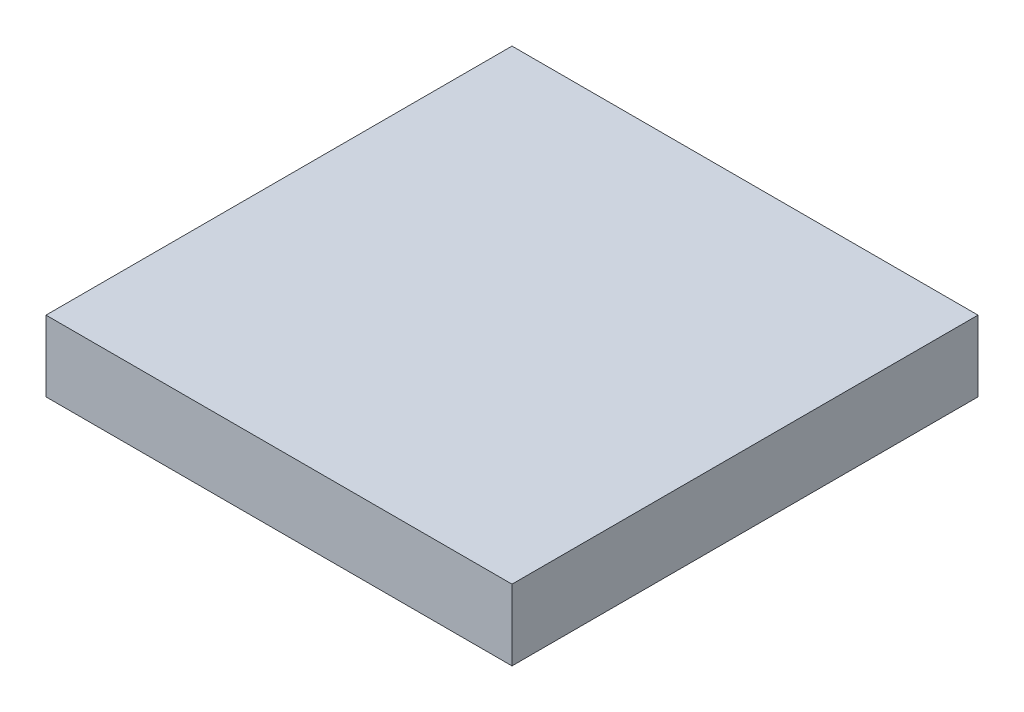
ISO-10303-21;
HEADER;
FILE_DESCRIPTION(('STEP AP214'),'2;1');
FILE_NAME('part.step','',(''),(''),'','','');
FILE_SCHEMA(('AUTOMOTIVE_DESIGN { 1 0 10303 214 1 1 1 1 }'));
ENDSEC;
DATA;
#1=APPLICATION_CONTEXT('core data for automotive mechanical design processes');
#2=APPLICATION_PROTOCOL_DEFINITION('international standard','automotive_design',2000,#1);
#3=PRODUCT_CONTEXT('',#1,'mechanical');
#4=PRODUCT('Part','Part','',(#3));
#5=PRODUCT_RELATED_PRODUCT_CATEGORY('part','',(#4));
#6=PRODUCT_DEFINITION_FORMATION('','',#4);
#7=PRODUCT_DEFINITION_CONTEXT('part definition',#1,'design');
#8=PRODUCT_DEFINITION('design','',#6,#7);
#9=PRODUCT_DEFINITION_SHAPE('','',#8);
#10=(LENGTH_UNIT() NAMED_UNIT(*) SI_UNIT(.MILLI.,.METRE.));
#11=(NAMED_UNIT(*) PLANE_ANGLE_UNIT() SI_UNIT($,.RADIAN.));
#12=(NAMED_UNIT(*) SI_UNIT($,.STERADIAN.) SOLID_ANGLE_UNIT());
#13=UNCERTAINTY_MEASURE_WITH_UNIT(LENGTH_MEASURE(1.E-05),#10,'distance_accuracy_value','');
#14=(GEOMETRIC_REPRESENTATION_CONTEXT(3) GLOBAL_UNCERTAINTY_ASSIGNED_CONTEXT((#13)) GLOBAL_UNIT_ASSIGNED_CONTEXT((#10,
#11,#12)) REPRESENTATION_CONTEXT('',''));
#15=CARTESIAN_POINT('',(0.,0.,0.));
#16=DIRECTION('',(0.,0.,1.));
#17=DIRECTION('',(1.,0.,0.));
#18=AXIS2_PLACEMENT_3D('',#15,#16,#17);
#19=CARTESIAN_POINT('',(4.99999999999997,1.52,-5.));
#20=DIRECTION('',(-1.,0.,0.));
#21=DIRECTION('',(0.,0.,1.));
#22=AXIS2_PLACEMENT_3D('',#19,#20,#21);
#23=PLANE('',#22);
#24=DIRECTION('',(0.,0.,-1.));
#25=VECTOR('',#24,1.);
#26=CARTESIAN_POINT('',(4.99999999999997,0.,-5.));
#27=LINE('',#26,#25);
#28=CARTESIAN_POINT('',(4.99999999999998,0.,5.));
#29=VERTEX_POINT('',#28);
#30=CARTESIAN_POINT('',(4.99999999999997,0.,-5.));
#31=VERTEX_POINT('',#30);
#32=EDGE_CURVE('E100',#29,#31,#27,.T.);
#33=ORIENTED_EDGE('',*,*,#32,.T.);
#34=DIRECTION('',(0.,-1.,0.));
#35=VECTOR('',#34,1.);
#36=CARTESIAN_POINT('',(4.99999999999997,1.52,-5.));
#37=LINE('',#36,#35);
#38=CARTESIAN_POINT('',(4.99999999999997,1.52,-5.));
#39=VERTEX_POINT('',#38);
#40=EDGE_CURVE('E11',#39,#31,#37,.T.);
#41=ORIENTED_EDGE('',*,*,#40,.F.);
#42=DIRECTION('',(0.,0.,-1.));
#43=VECTOR('',#42,1.);
#44=CARTESIAN_POINT('',(4.99999999999997,1.52,-5.));
#45=LINE('',#44,#43);
#46=CARTESIAN_POINT('',(4.99999999999998,1.52,5.));
#47=VERTEX_POINT('',#46);
#48=EDGE_CURVE('E88',#47,#39,#45,.T.);
#49=ORIENTED_EDGE('',*,*,#48,.F.);
#50=DIRECTION('',(0.,-1.,0.));
#51=VECTOR('',#50,1.);
#52=CARTESIAN_POINT('',(4.99999999999998,1.52,5.));
#53=LINE('',#52,#51);
#54=EDGE_CURVE('E96',#47,#29,#53,.T.);
#55=ORIENTED_EDGE('',*,*,#54,.T.);
#56=EDGE_LOOP('',(#33,#41,#49,#55));
#57=FACE_BOUND('',#56,.T.);
#58=ADVANCED_FACE('F37',(#57),#23,.F.);
#59=CARTESIAN_POINT('',(-5.00000000000001,1.52,-5.));
#60=DIRECTION('',(0.,0.,1.));
#61=DIRECTION('',(1.,0.,0.));
#62=AXIS2_PLACEMENT_3D('',#59,#60,#61);
#63=PLANE('',#62);
#64=DIRECTION('',(-1.,0.,0.));
#65=VECTOR('',#64,1.);
#66=CARTESIAN_POINT('',(-5.00000000000001,0.,-5.));
#67=LINE('',#66,#65);
#68=CARTESIAN_POINT('',(-5.00000000000001,0.,-5.));
#69=VERTEX_POINT('',#68);
#70=EDGE_CURVE('E92',#31,#69,#67,.T.);
#71=ORIENTED_EDGE('',*,*,#70,.T.);
#72=DIRECTION('',(0.,-1.,0.));
#73=VECTOR('',#72,1.);
#74=CARTESIAN_POINT('',(-5.00000000000001,1.52,-5.));
#75=LINE('',#74,#73);
#76=CARTESIAN_POINT('',(-5.00000000000001,1.52,-5.));
#77=VERTEX_POINT('',#76);
#78=EDGE_CURVE('E45',#77,#69,#75,.T.);
#79=ORIENTED_EDGE('',*,*,#78,.F.);
#80=DIRECTION('',(-1.,0.,0.));
#81=VECTOR('',#80,1.);
#82=CARTESIAN_POINT('',(-5.00000000000001,1.52,-5.));
#83=LINE('',#82,#81);
#84=EDGE_CURVE('E83',#39,#77,#83,.T.);
#85=ORIENTED_EDGE('',*,*,#84,.F.);
#86=ORIENTED_EDGE('',*,*,#40,.T.);
#87=EDGE_LOOP('',(#71,#79,#85,#86));
#88=FACE_BOUND('',#87,.T.);
#89=ADVANCED_FACE('F91',(#88),#63,.F.);
#90=CARTESIAN_POINT('',(-5.00000000000001,1.52,-5.));
#91=DIRECTION('',(1.,0.,0.));
#92=DIRECTION('',(0.,0.,-1.));
#93=AXIS2_PLACEMENT_3D('',#90,#91,#92);
#94=PLANE('',#93);
#95=DIRECTION('',(0.,0.,1.));
#96=VECTOR('',#95,1.);
#97=CARTESIAN_POINT('',(-5.00000000000001,0.,-5.));
#98=LINE('',#97,#96);
#99=CARTESIAN_POINT('',(-5.00000000000001,0.,5.));
#100=VERTEX_POINT('',#99);
#101=EDGE_CURVE('E70',#69,#100,#98,.T.);
#102=ORIENTED_EDGE('',*,*,#101,.T.);
#103=DIRECTION('',(0.,-1.,0.));
#104=VECTOR('',#103,1.);
#105=CARTESIAN_POINT('',(-5.00000000000001,1.52,5.));
#106=LINE('',#105,#104);
#107=CARTESIAN_POINT('',(-5.00000000000001,1.52,5.));
#108=VERTEX_POINT('',#107);
#109=EDGE_CURVE('E93',#108,#100,#106,.T.);
#110=ORIENTED_EDGE('',*,*,#109,.F.);
#111=DIRECTION('',(0.,0.,1.));
#112=VECTOR('',#111,1.);
#113=CARTESIAN_POINT('',(-5.00000000000001,1.52,-5.));
#114=LINE('',#113,#112);
#115=EDGE_CURVE('E86',#77,#108,#114,.T.);
#116=ORIENTED_EDGE('',*,*,#115,.F.);
#117=ORIENTED_EDGE('',*,*,#78,.T.);
#118=EDGE_LOOP('',(#102,#110,#116,#117));
#119=FACE_BOUND('',#118,.T.);
#120=ADVANCED_FACE('F94',(#119),#94,.F.);
#121=CARTESIAN_POINT('',(-5.00000000000001,1.52,5.));
#122=DIRECTION('',(0.,0.,-1.));
#123=DIRECTION('',(-1.,0.,0.));
#124=AXIS2_PLACEMENT_3D('',#121,#122,#123);
#125=PLANE('',#124);
#126=DIRECTION('',(1.,0.,0.));
#127=VECTOR('',#126,1.);
#128=CARTESIAN_POINT('',(-5.00000000000001,0.,5.));
#129=LINE('',#128,#127);
#130=EDGE_CURVE('E76',#100,#29,#129,.T.);
#131=ORIENTED_EDGE('',*,*,#130,.T.);
#132=ORIENTED_EDGE('',*,*,#54,.F.);
#133=DIRECTION('',(1.,0.,0.));
#134=VECTOR('',#133,1.);
#135=CARTESIAN_POINT('',(-5.00000000000001,1.52,5.));
#136=LINE('',#135,#134);
#137=EDGE_CURVE('E53',#108,#47,#136,.T.);
#138=ORIENTED_EDGE('',*,*,#137,.F.);
#139=ORIENTED_EDGE('',*,*,#109,.T.);
#140=EDGE_LOOP('',(#131,#132,#138,#139));
#141=FACE_BOUND('',#140,.T.);
#142=ADVANCED_FACE('F107',(#141),#125,.F.);
#143=CARTESIAN_POINT('',(0.,1.52,0.));
#144=DIRECTION('',(0.,1.,0.));
#145=DIRECTION('',(0.,0.,1.));
#146=AXIS2_PLACEMENT_3D('',#143,#144,#145);
#147=PLANE('',#146);
#148=ORIENTED_EDGE('',*,*,#48,.T.);
#149=ORIENTED_EDGE('',*,*,#84,.T.);
#150=ORIENTED_EDGE('',*,*,#115,.T.);
#151=ORIENTED_EDGE('',*,*,#137,.T.);
#152=EDGE_LOOP('',(#148,#149,#150,#151));
#153=FACE_BOUND('',#152,.T.);
#154=ADVANCED_FACE('F84',(#153),#147,.T.);
#155=CARTESIAN_POINT('',(0.,0.,0.));
#156=DIRECTION('',(0.,1.,0.));
#157=DIRECTION('',(0.,0.,1.));
#158=AXIS2_PLACEMENT_3D('',#155,#156,#157);
#159=PLANE('',#158);
#160=ORIENTED_EDGE('',*,*,#32,.F.);
#161=ORIENTED_EDGE('',*,*,#130,.F.);
#162=ORIENTED_EDGE('',*,*,#101,.F.);
#163=ORIENTED_EDGE('',*,*,#70,.F.);
#164=EDGE_LOOP('',(#160,#161,#162,#163));
#165=FACE_BOUND('',#164,.T.);
#166=ADVANCED_FACE('F110',(#165),#159,.F.);
#167=CLOSED_SHELL('',(#58,#89,#120,#142,#154,#166));
#168=MANIFOLD_SOLID_BREP('B2',#167);
#169=ADVANCED_BREP_SHAPE_REPRESENTATION('',(#18,#168),#14);
#170=SHAPE_DEFINITION_REPRESENTATION(#9,#169);
ENDSEC;
END-ISO-10303-21;
